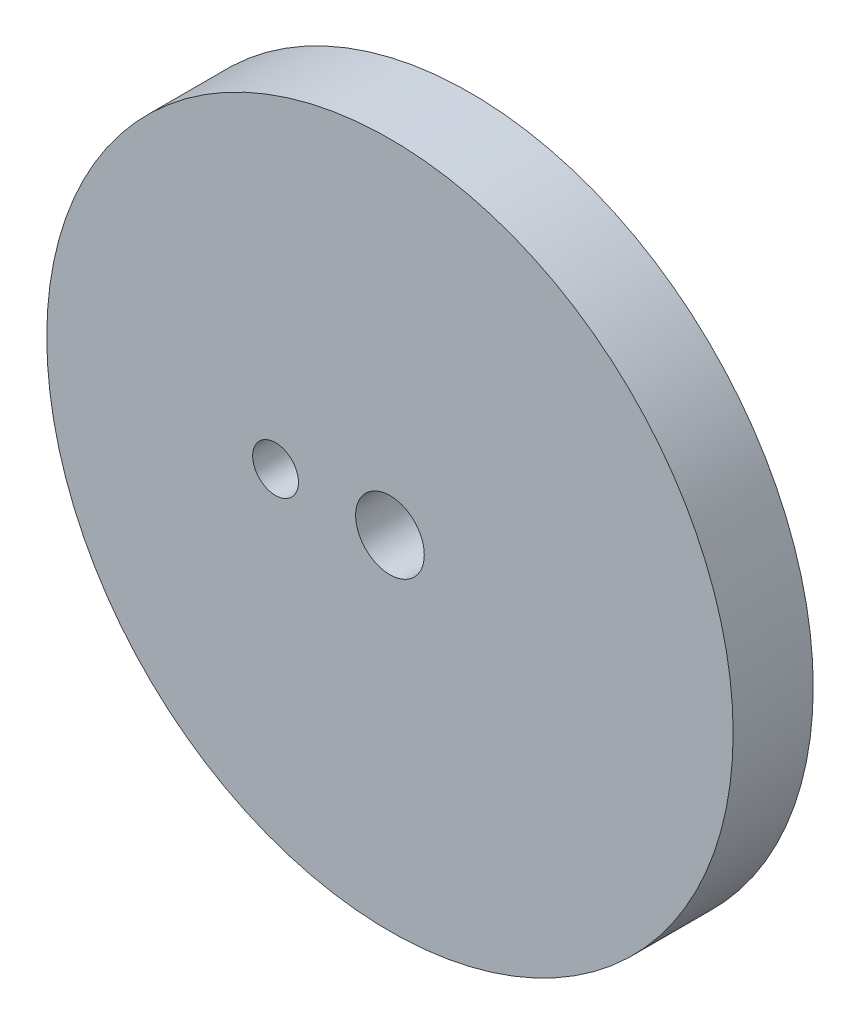
ISO-10303-21;
HEADER;
FILE_DESCRIPTION(('STEP AP214'),'2;1');
FILE_NAME('part.step','',(''),(''),'','','');
FILE_SCHEMA(('AUTOMOTIVE_DESIGN { 1 0 10303 214 1 1 1 1 }'));
ENDSEC;
DATA;
#1=APPLICATION_CONTEXT('core data for automotive mechanical design processes');
#2=APPLICATION_PROTOCOL_DEFINITION('international standard','automotive_design',2000,#1);
#3=PRODUCT_CONTEXT('',#1,'mechanical');
#4=PRODUCT('Part','Part','',(#3));
#5=PRODUCT_RELATED_PRODUCT_CATEGORY('part','',(#4));
#6=PRODUCT_DEFINITION_FORMATION('','',#4);
#7=PRODUCT_DEFINITION_CONTEXT('part definition',#1,'design');
#8=PRODUCT_DEFINITION('design','',#6,#7);
#9=PRODUCT_DEFINITION_SHAPE('','',#8);
#10=(LENGTH_UNIT() NAMED_UNIT(*) SI_UNIT(.MILLI.,.METRE.));
#11=(NAMED_UNIT(*) PLANE_ANGLE_UNIT() SI_UNIT($,.RADIAN.));
#12=(NAMED_UNIT(*) SI_UNIT($,.STERADIAN.) SOLID_ANGLE_UNIT());
#13=UNCERTAINTY_MEASURE_WITH_UNIT(LENGTH_MEASURE(1.E-05),#10,'distance_accuracy_value','');
#14=(GEOMETRIC_REPRESENTATION_CONTEXT(3) GLOBAL_UNCERTAINTY_ASSIGNED_CONTEXT((#13)) GLOBAL_UNIT_ASSIGNED_CONTEXT((#10,
#11,#12)) REPRESENTATION_CONTEXT('',''));
#15=CARTESIAN_POINT('',(0.,0.,0.));
#16=DIRECTION('',(0.,0.,1.));
#17=DIRECTION('',(1.,0.,0.));
#18=AXIS2_PLACEMENT_3D('',#15,#16,#17);
#19=CARTESIAN_POINT('',(0.,0.,7.));
#20=DIRECTION('',(0.,0.,1.));
#21=DIRECTION('',(1.,0.,0.));
#22=AXIS2_PLACEMENT_3D('',#19,#20,#21);
#23=PLANE('',#22);
#24=CARTESIAN_POINT('',(0.,0.,7.));
#25=DIRECTION('',(0.,0.,1.));
#26=DIRECTION('',(1.,0.,0.));
#27=AXIS2_PLACEMENT_3D('',#24,#25,#26);
#28=CIRCLE('',#27,3.);
#29=CARTESIAN_POINT('',(3.,0.,7.));
#30=VERTEX_POINT('',#29);
#31=EDGE_CURVE('E40',#30,#30,#28,.T.);
#32=ORIENTED_EDGE('',*,*,#31,.F.);
#33=EDGE_LOOP('',(#32));
#34=FACE_BOUND('',#33,.T.);
#35=CARTESIAN_POINT('',(0.,0.,7.));
#36=DIRECTION('',(0.,0.,1.));
#37=DIRECTION('',(1.,0.,0.));
#38=AXIS2_PLACEMENT_3D('',#35,#36,#37);
#39=CIRCLE('',#38,30.);
#40=CARTESIAN_POINT('',(30.,0.,7.));
#41=VERTEX_POINT('',#40);
#42=EDGE_CURVE('E10',#41,#41,#39,.T.);
#43=ORIENTED_EDGE('',*,*,#42,.T.);
#44=EDGE_LOOP('',(#43));
#45=FACE_BOUND('',#44,.T.);
#46=CARTESIAN_POINT('',(-10.,0.,7.));
#47=DIRECTION('',(0.,0.,1.));
#48=DIRECTION('',(1.,0.,0.));
#49=AXIS2_PLACEMENT_3D('',#46,#47,#48);
#50=CIRCLE('',#49,2.);
#51=CARTESIAN_POINT('',(-8.,0.,7.));
#52=VERTEX_POINT('',#51);
#53=EDGE_CURVE('E49',#52,#52,#50,.T.);
#54=ORIENTED_EDGE('',*,*,#53,.F.);
#55=EDGE_LOOP('',(#54));
#56=FACE_BOUND('',#55,.T.);
#57=ADVANCED_FACE('F29',(#34,#45,#56),#23,.T.);
#58=CARTESIAN_POINT('',(0.,0.,0.));
#59=DIRECTION('',(0.,0.,1.));
#60=DIRECTION('',(1.,0.,0.));
#61=AXIS2_PLACEMENT_3D('',#58,#59,#60);
#62=PLANE('',#61);
#63=CARTESIAN_POINT('',(0.,0.,0.));
#64=DIRECTION('',(0.,0.,1.));
#65=DIRECTION('',(1.,0.,0.));
#66=AXIS2_PLACEMENT_3D('',#63,#64,#65);
#67=CIRCLE('',#66,3.);
#68=CARTESIAN_POINT('',(3.,0.,0.));
#69=VERTEX_POINT('',#68);
#70=EDGE_CURVE('E44',#69,#69,#67,.T.);
#71=ORIENTED_EDGE('',*,*,#70,.T.);
#72=EDGE_LOOP('',(#71));
#73=FACE_BOUND('',#72,.T.);
#74=CARTESIAN_POINT('',(0.,0.,0.));
#75=DIRECTION('',(0.,0.,1.));
#76=DIRECTION('',(1.,0.,0.));
#77=AXIS2_PLACEMENT_3D('',#74,#75,#76);
#78=CIRCLE('',#77,30.);
#79=CARTESIAN_POINT('',(30.,0.,0.));
#80=VERTEX_POINT('',#79);
#81=EDGE_CURVE('E36',#80,#80,#78,.T.);
#82=ORIENTED_EDGE('',*,*,#81,.F.);
#83=EDGE_LOOP('',(#82));
#84=FACE_BOUND('',#83,.T.);
#85=CARTESIAN_POINT('',(-10.,0.,0.));
#86=DIRECTION('',(0.,0.,1.));
#87=DIRECTION('',(1.,0.,0.));
#88=AXIS2_PLACEMENT_3D('',#85,#86,#87);
#89=CIRCLE('',#88,2.);
#90=CARTESIAN_POINT('',(-8.,0.,0.));
#91=VERTEX_POINT('',#90);
#92=EDGE_CURVE('E52',#91,#91,#89,.T.);
#93=ORIENTED_EDGE('',*,*,#92,.T.);
#94=EDGE_LOOP('',(#93));
#95=FACE_BOUND('',#94,.T.);
#96=ADVANCED_FACE('F56',(#73,#84,#95),#62,.F.);
#97=CARTESIAN_POINT('',(0.,0.,7.));
#98=DIRECTION('',(0.,0.,-1.));
#99=DIRECTION('',(-1.,0.,0.));
#100=AXIS2_PLACEMENT_3D('',#97,#98,#99);
#101=CYLINDRICAL_SURFACE('',#100,30.);
#102=ORIENTED_EDGE('',*,*,#42,.F.);
#103=EDGE_LOOP('',(#102));
#104=FACE_BOUND('',#103,.T.);
#105=ORIENTED_EDGE('',*,*,#81,.T.);
#106=EDGE_LOOP('',(#105));
#107=FACE_BOUND('',#106,.T.);
#108=ADVANCED_FACE('F31',(#104,#107),#101,.T.);
#109=CARTESIAN_POINT('',(0.,0.,7.));
#110=DIRECTION('',(0.,0.,-1.));
#111=DIRECTION('',(-1.,0.,0.));
#112=AXIS2_PLACEMENT_3D('',#109,#110,#111);
#113=CYLINDRICAL_SURFACE('',#112,3.);
#114=ORIENTED_EDGE('',*,*,#31,.T.);
#115=EDGE_LOOP('',(#114));
#116=FACE_BOUND('',#115,.T.);
#117=ORIENTED_EDGE('',*,*,#70,.F.);
#118=EDGE_LOOP('',(#117));
#119=FACE_BOUND('',#118,.T.);
#120=ADVANCED_FACE('F60',(#116,#119),#113,.F.);
#121=CARTESIAN_POINT('',(-10.,0.,7.));
#122=DIRECTION('',(0.,0.,-1.));
#123=DIRECTION('',(-1.,0.,0.));
#124=AXIS2_PLACEMENT_3D('',#121,#122,#123);
#125=CYLINDRICAL_SURFACE('',#124,2.);
#126=ORIENTED_EDGE('',*,*,#53,.T.);
#127=EDGE_LOOP('',(#126));
#128=FACE_BOUND('',#127,.T.);
#129=ORIENTED_EDGE('',*,*,#92,.F.);
#130=EDGE_LOOP('',(#129));
#131=FACE_BOUND('',#130,.T.);
#132=ADVANCED_FACE('F58',(#128,#131),#125,.F.);
#133=CLOSED_SHELL('',(#57,#96,#108,#120,#132));
#134=MANIFOLD_SOLID_BREP('B2',#133);
#135=ADVANCED_BREP_SHAPE_REPRESENTATION('',(#18,#134),#14);
#136=SHAPE_DEFINITION_REPRESENTATION(#9,#135);
ENDSEC;
END-ISO-10303-21;
